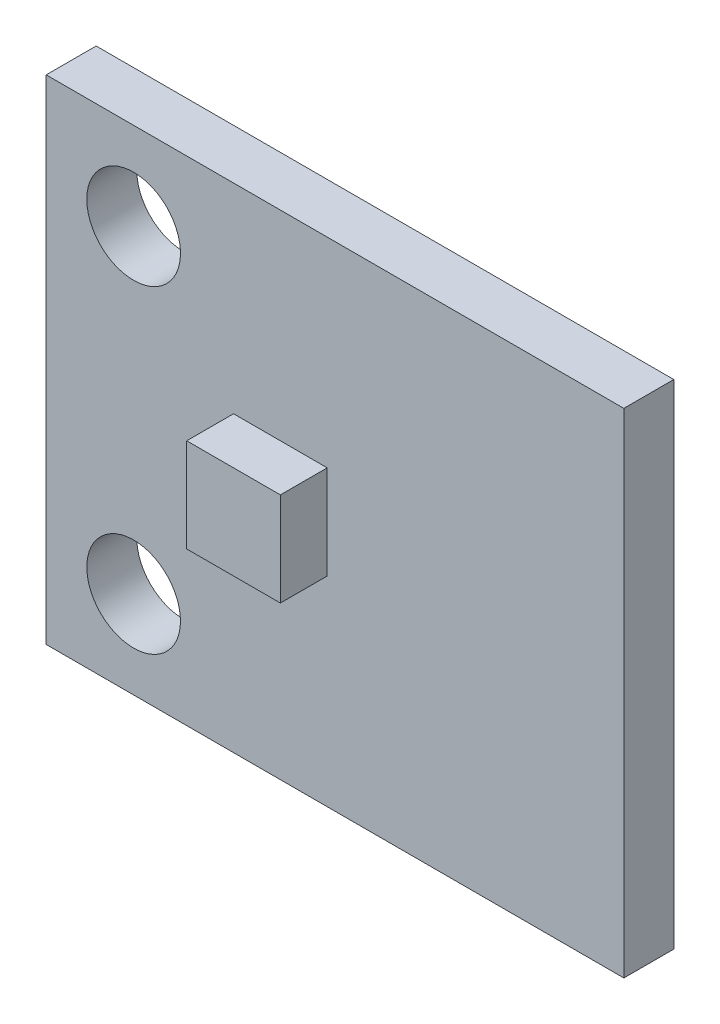
ISO-10303-21;
HEADER;
FILE_DESCRIPTION(('STEP AP214'),'2;1');
FILE_NAME('part.step','',(''),(''),'','','');
FILE_SCHEMA(('AUTOMOTIVE_DESIGN { 1 0 10303 214 1 1 1 1 }'));
ENDSEC;
DATA;
#1=APPLICATION_CONTEXT('core data for automotive mechanical design processes');
#2=APPLICATION_PROTOCOL_DEFINITION('international standard','automotive_design',2000,#1);
#3=PRODUCT_CONTEXT('',#1,'mechanical');
#4=PRODUCT('Part','Part','',(#3));
#5=PRODUCT_RELATED_PRODUCT_CATEGORY('part','',(#4));
#6=PRODUCT_DEFINITION_FORMATION('','',#4);
#7=PRODUCT_DEFINITION_CONTEXT('part definition',#1,'design');
#8=PRODUCT_DEFINITION('design','',#6,#7);
#9=PRODUCT_DEFINITION_SHAPE('','',#8);
#10=(LENGTH_UNIT() NAMED_UNIT(*) SI_UNIT(.MILLI.,.METRE.));
#11=(NAMED_UNIT(*) PLANE_ANGLE_UNIT() SI_UNIT($,.RADIAN.));
#12=(NAMED_UNIT(*) SI_UNIT($,.STERADIAN.) SOLID_ANGLE_UNIT());
#13=UNCERTAINTY_MEASURE_WITH_UNIT(LENGTH_MEASURE(1.E-05),#10,'distance_accuracy_value','');
#14=(GEOMETRIC_REPRESENTATION_CONTEXT(3) GLOBAL_UNCERTAINTY_ASSIGNED_CONTEXT((#13)) GLOBAL_UNIT_ASSIGNED_CONTEXT((#10,
#11,#12)) REPRESENTATION_CONTEXT('',''));
#15=CARTESIAN_POINT('',(0.,0.,0.));
#16=DIRECTION('',(0.,0.,1.));
#17=DIRECTION('',(1.,0.,0.));
#18=AXIS2_PLACEMENT_3D('',#15,#16,#17);
#19=CARTESIAN_POINT('',(0.,0.,1.6));
#20=DIRECTION('',(0.,0.,-1.));
#21=DIRECTION('',(-1.,0.,0.));
#22=AXIS2_PLACEMENT_3D('',#19,#20,#21);
#23=PLANE('',#22);
#24=DIRECTION('',(0.,-1.,0.));
#25=VECTOR('',#24,1.);
#26=CARTESIAN_POINT('',(0.,0.,1.6));
#27=LINE('',#26,#25);
#28=CARTESIAN_POINT('',(0.,15.8,1.6));
#29=VERTEX_POINT('',#28);
#30=CARTESIAN_POINT('',(0.,0.,1.6));
#31=VERTEX_POINT('',#30);
#32=EDGE_CURVE('E137',#29,#31,#27,.T.);
#33=ORIENTED_EDGE('',*,*,#32,.T.);
#34=DIRECTION('',(1.,0.,0.));
#35=VECTOR('',#34,1.);
#36=CARTESIAN_POINT('',(0.,0.,1.6));
#37=LINE('',#36,#35);
#38=CARTESIAN_POINT('',(18.5,0.,1.6));
#39=VERTEX_POINT('',#38);
#40=EDGE_CURVE('E140',#31,#39,#37,.T.);
#41=ORIENTED_EDGE('',*,*,#40,.T.);
#42=DIRECTION('',(0.,1.,0.));
#43=VECTOR('',#42,1.);
#44=CARTESIAN_POINT('',(18.5,0.,1.6));
#45=LINE('',#44,#43);
#46=CARTESIAN_POINT('',(18.5,15.8,1.6));
#47=VERTEX_POINT('',#46);
#48=EDGE_CURVE('E143',#39,#47,#45,.T.);
#49=ORIENTED_EDGE('',*,*,#48,.T.);
#50=DIRECTION('',(-1.,0.,0.));
#51=VECTOR('',#50,1.);
#52=CARTESIAN_POINT('',(0.,15.8,1.6));
#53=LINE('',#52,#51);
#54=EDGE_CURVE('E145',#47,#29,#53,.T.);
#55=ORIENTED_EDGE('',*,*,#54,.T.);
#56=EDGE_LOOP('',(#33,#41,#49,#55));
#57=FACE_BOUND('',#56,.T.);
#58=CARTESIAN_POINT('',(2.8,2.8,1.6));
#59=DIRECTION('',(0.,0.,-1.));
#60=DIRECTION('',(1.,0.,0.));
#61=AXIS2_PLACEMENT_3D('',#58,#59,#60);
#62=CIRCLE('',#61,1.5);
#63=CARTESIAN_POINT('',(4.3,2.8,1.6));
#64=VERTEX_POINT('',#63);
#65=EDGE_CURVE('E122',#64,#64,#62,.T.);
#66=ORIENTED_EDGE('',*,*,#65,.T.);
#67=EDGE_LOOP('',(#66));
#68=FACE_BOUND('',#67,.T.);
#69=CARTESIAN_POINT('',(2.8,13.,1.6));
#70=DIRECTION('',(0.,0.,-1.));
#71=DIRECTION('',(-1.,0.,0.));
#72=AXIS2_PLACEMENT_3D('',#69,#70,#71);
#73=CIRCLE('',#72,1.5);
#74=CARTESIAN_POINT('',(1.3,13.,1.6));
#75=VERTEX_POINT('',#74);
#76=EDGE_CURVE('E128',#75,#75,#73,.T.);
#77=ORIENTED_EDGE('',*,*,#76,.T.);
#78=EDGE_LOOP('',(#77));
#79=FACE_BOUND('',#78,.T.);
#80=DIRECTION('',(0.,-1.,0.));
#81=VECTOR('',#80,1.);
#82=CARTESIAN_POINT('',(6.,9.4,1.6));
#83=LINE('',#82,#81);
#84=CARTESIAN_POINT('',(6.,9.4,1.6));
#85=VERTEX_POINT('',#84);
#86=CARTESIAN_POINT('',(6.,6.4,1.6));
#87=VERTEX_POINT('',#86);
#88=EDGE_CURVE('E118',#85,#87,#83,.T.);
#89=ORIENTED_EDGE('',*,*,#88,.F.);
#90=DIRECTION('',(-1.,0.,0.));
#91=VECTOR('',#90,1.);
#92=CARTESIAN_POINT('',(6.,9.4,1.6));
#93=LINE('',#92,#91);
#94=CARTESIAN_POINT('',(9.,9.4,1.6));
#95=VERTEX_POINT('',#94);
#96=EDGE_CURVE('E115',#95,#85,#93,.T.);
#97=ORIENTED_EDGE('',*,*,#96,.F.);
#98=DIRECTION('',(0.,1.,0.));
#99=VECTOR('',#98,1.);
#100=CARTESIAN_POINT('',(9.,9.4,1.6));
#101=LINE('',#100,#99);
#102=CARTESIAN_POINT('',(9.,6.4,1.6));
#103=VERTEX_POINT('',#102);
#104=EDGE_CURVE('E53',#103,#95,#101,.T.);
#105=ORIENTED_EDGE('',*,*,#104,.F.);
#106=DIRECTION('',(1.,0.,0.));
#107=VECTOR('',#106,1.);
#108=CARTESIAN_POINT('',(6.,6.4,1.6));
#109=LINE('',#108,#107);
#110=EDGE_CURVE('E48',#87,#103,#109,.T.);
#111=ORIENTED_EDGE('',*,*,#110,.F.);
#112=EDGE_LOOP('',(#89,#97,#105,#111));
#113=FACE_BOUND('',#112,.T.);
#114=ADVANCED_FACE('F33',(#57,#68,#79,#113),#23,.F.);
#115=CARTESIAN_POINT('',(0.,0.,1.6));
#116=DIRECTION('',(1.,0.,0.));
#117=DIRECTION('',(0.,0.,-1.));
#118=AXIS2_PLACEMENT_3D('',#115,#116,#117);
#119=PLANE('',#118);
#120=DIRECTION('',(0.,-1.,0.));
#121=VECTOR('',#120,1.);
#122=CARTESIAN_POINT('',(0.,0.,0.));
#123=LINE('',#122,#121);
#124=CARTESIAN_POINT('',(0.,15.8,0.));
#125=VERTEX_POINT('',#124);
#126=CARTESIAN_POINT('',(0.,0.,0.));
#127=VERTEX_POINT('',#126);
#128=EDGE_CURVE('E131',#125,#127,#123,.T.);
#129=ORIENTED_EDGE('',*,*,#128,.T.);
#130=DIRECTION('',(0.,0.,-1.));
#131=VECTOR('',#130,1.);
#132=CARTESIAN_POINT('',(0.,0.,1.6));
#133=LINE('',#132,#131);
#134=EDGE_CURVE('E11',#31,#127,#133,.T.);
#135=ORIENTED_EDGE('',*,*,#134,.F.);
#136=ORIENTED_EDGE('',*,*,#32,.F.);
#137=DIRECTION('',(0.,0.,-1.));
#138=VECTOR('',#137,1.);
#139=CARTESIAN_POINT('',(0.,15.8,1.6));
#140=LINE('',#139,#138);
#141=EDGE_CURVE('E147',#29,#125,#140,.T.);
#142=ORIENTED_EDGE('',*,*,#141,.T.);
#143=EDGE_LOOP('',(#129,#135,#136,#142));
#144=FACE_BOUND('',#143,.T.);
#145=ADVANCED_FACE('F35',(#144),#119,.F.);
#146=CARTESIAN_POINT('',(0.,0.,1.6));
#147=DIRECTION('',(0.,1.,0.));
#148=DIRECTION('',(0.,0.,1.));
#149=AXIS2_PLACEMENT_3D('',#146,#147,#148);
#150=PLANE('',#149);
#151=DIRECTION('',(1.,0.,0.));
#152=VECTOR('',#151,1.);
#153=CARTESIAN_POINT('',(0.,0.,0.));
#154=LINE('',#153,#152);
#155=CARTESIAN_POINT('',(18.5,0.,0.));
#156=VERTEX_POINT('',#155);
#157=EDGE_CURVE('E150',#127,#156,#154,.T.);
#158=ORIENTED_EDGE('',*,*,#157,.T.);
#159=DIRECTION('',(0.,0.,-1.));
#160=VECTOR('',#159,1.);
#161=CARTESIAN_POINT('',(18.5,0.,1.6));
#162=LINE('',#161,#160);
#163=EDGE_CURVE('E41',#39,#156,#162,.T.);
#164=ORIENTED_EDGE('',*,*,#163,.F.);
#165=ORIENTED_EDGE('',*,*,#40,.F.);
#166=ORIENTED_EDGE('',*,*,#134,.T.);
#167=EDGE_LOOP('',(#158,#164,#165,#166));
#168=FACE_BOUND('',#167,.T.);
#169=ADVANCED_FACE('F180',(#168),#150,.F.);
#170=CARTESIAN_POINT('',(18.5,0.,1.6));
#171=DIRECTION('',(-1.,0.,0.));
#172=DIRECTION('',(0.,0.,1.));
#173=AXIS2_PLACEMENT_3D('',#170,#171,#172);
#174=PLANE('',#173);
#175=DIRECTION('',(0.,1.,0.));
#176=VECTOR('',#175,1.);
#177=CARTESIAN_POINT('',(18.5,0.,0.));
#178=LINE('',#177,#176);
#179=CARTESIAN_POINT('',(18.5,15.8,0.));
#180=VERTEX_POINT('',#179);
#181=EDGE_CURVE('E152',#156,#180,#178,.T.);
#182=ORIENTED_EDGE('',*,*,#181,.T.);
#183=DIRECTION('',(0.,0.,-1.));
#184=VECTOR('',#183,1.);
#185=CARTESIAN_POINT('',(18.5,15.8,1.6));
#186=LINE('',#185,#184);
#187=EDGE_CURVE('E157',#47,#180,#186,.T.);
#188=ORIENTED_EDGE('',*,*,#187,.F.);
#189=ORIENTED_EDGE('',*,*,#48,.F.);
#190=ORIENTED_EDGE('',*,*,#163,.T.);
#191=EDGE_LOOP('',(#182,#188,#189,#190));
#192=FACE_BOUND('',#191,.T.);
#193=ADVANCED_FACE('F164',(#192),#174,.F.);
#194=CARTESIAN_POINT('',(0.,15.8,1.6));
#195=DIRECTION('',(0.,-1.,0.));
#196=DIRECTION('',(0.,0.,-1.));
#197=AXIS2_PLACEMENT_3D('',#194,#195,#196);
#198=PLANE('',#197);
#199=DIRECTION('',(-1.,0.,0.));
#200=VECTOR('',#199,1.);
#201=CARTESIAN_POINT('',(0.,15.8,0.));
#202=LINE('',#201,#200);
#203=EDGE_CURVE('E141',#180,#125,#202,.T.);
#204=ORIENTED_EDGE('',*,*,#203,.T.);
#205=ORIENTED_EDGE('',*,*,#141,.F.);
#206=ORIENTED_EDGE('',*,*,#54,.F.);
#207=ORIENTED_EDGE('',*,*,#187,.T.);
#208=EDGE_LOOP('',(#204,#205,#206,#207));
#209=FACE_BOUND('',#208,.T.);
#210=ADVANCED_FACE('F173',(#209),#198,.F.);
#211=CARTESIAN_POINT('',(0.,0.,0.));
#212=DIRECTION('',(0.,0.,-1.));
#213=DIRECTION('',(-1.,0.,0.));
#214=AXIS2_PLACEMENT_3D('',#211,#212,#213);
#215=PLANE('',#214);
#216=CARTESIAN_POINT('',(2.8,13.,0.));
#217=DIRECTION('',(0.,0.,-1.));
#218=DIRECTION('',(-1.,0.,0.));
#219=AXIS2_PLACEMENT_3D('',#216,#217,#218);
#220=CIRCLE('',#219,1.5);
#221=CARTESIAN_POINT('',(1.3,13.,0.));
#222=VERTEX_POINT('',#221);
#223=EDGE_CURVE('E132',#222,#222,#220,.T.);
#224=ORIENTED_EDGE('',*,*,#223,.F.);
#225=EDGE_LOOP('',(#224));
#226=FACE_BOUND('',#225,.T.);
#227=CARTESIAN_POINT('',(2.8,2.8,0.));
#228=DIRECTION('',(0.,0.,-1.));
#229=DIRECTION('',(1.,0.,0.));
#230=AXIS2_PLACEMENT_3D('',#227,#228,#229);
#231=CIRCLE('',#230,1.5);
#232=CARTESIAN_POINT('',(4.3,2.8,0.));
#233=VERTEX_POINT('',#232);
#234=EDGE_CURVE('E119',#233,#233,#231,.T.);
#235=ORIENTED_EDGE('',*,*,#234,.F.);
#236=EDGE_LOOP('',(#235));
#237=FACE_BOUND('',#236,.T.);
#238=ORIENTED_EDGE('',*,*,#128,.F.);
#239=ORIENTED_EDGE('',*,*,#203,.F.);
#240=ORIENTED_EDGE('',*,*,#181,.F.);
#241=ORIENTED_EDGE('',*,*,#157,.F.);
#242=EDGE_LOOP('',(#238,#239,#240,#241));
#243=FACE_BOUND('',#242,.T.);
#244=ADVANCED_FACE('F170',(#226,#237,#243),#215,.T.);
#245=CARTESIAN_POINT('',(2.8,2.8,1.6));
#246=DIRECTION('',(0.,0.,-1.));
#247=DIRECTION('',(-1.,0.,0.));
#248=AXIS2_PLACEMENT_3D('',#245,#246,#247);
#249=CYLINDRICAL_SURFACE('',#248,1.5);
#250=ORIENTED_EDGE('',*,*,#65,.F.);
#251=EDGE_LOOP('',(#250));
#252=FACE_BOUND('',#251,.T.);
#253=ORIENTED_EDGE('',*,*,#234,.T.);
#254=EDGE_LOOP('',(#253));
#255=FACE_BOUND('',#254,.T.);
#256=ADVANCED_FACE('F193',(#252,#255),#249,.F.);
#257=CARTESIAN_POINT('',(2.8,13.,1.6));
#258=DIRECTION('',(0.,0.,-1.));
#259=DIRECTION('',(-1.,0.,0.));
#260=AXIS2_PLACEMENT_3D('',#257,#258,#259);
#261=CYLINDRICAL_SURFACE('',#260,1.5);
#262=ORIENTED_EDGE('',*,*,#76,.F.);
#263=EDGE_LOOP('',(#262));
#264=FACE_BOUND('',#263,.T.);
#265=ORIENTED_EDGE('',*,*,#223,.T.);
#266=EDGE_LOOP('',(#265));
#267=FACE_BOUND('',#266,.T.);
#268=ADVANCED_FACE('F213',(#264,#267),#261,.F.);
#269=CARTESIAN_POINT('',(6.,9.4,3.1));
#270=DIRECTION('',(1.,0.,0.));
#271=DIRECTION('',(0.,0.,-1.));
#272=AXIS2_PLACEMENT_3D('',#269,#270,#271);
#273=PLANE('',#272);
#274=ORIENTED_EDGE('',*,*,#88,.T.);
#275=DIRECTION('',(0.,0.,-1.));
#276=VECTOR('',#275,1.);
#277=CARTESIAN_POINT('',(6.,6.4,3.1));
#278=LINE('',#277,#276);
#279=CARTESIAN_POINT('',(6.,6.4,3.1));
#280=VERTEX_POINT('',#279);
#281=EDGE_CURVE('E99',#280,#87,#278,.T.);
#282=ORIENTED_EDGE('',*,*,#281,.F.);
#283=DIRECTION('',(0.,-1.,0.));
#284=VECTOR('',#283,1.);
#285=CARTESIAN_POINT('',(6.,9.4,3.1));
#286=LINE('',#285,#284);
#287=CARTESIAN_POINT('',(6.,9.4,3.1));
#288=VERTEX_POINT('',#287);
#289=EDGE_CURVE('E106',#288,#280,#286,.T.);
#290=ORIENTED_EDGE('',*,*,#289,.F.);
#291=DIRECTION('',(0.,0.,-1.));
#292=VECTOR('',#291,1.);
#293=CARTESIAN_POINT('',(6.,9.4,3.1));
#294=LINE('',#293,#292);
#295=EDGE_CURVE('E294',#288,#85,#294,.T.);
#296=ORIENTED_EDGE('',*,*,#295,.T.);
#297=EDGE_LOOP('',(#274,#282,#290,#296));
#298=FACE_BOUND('',#297,.T.);
#299=ADVANCED_FACE('F117',(#298),#273,.F.);
#300=CARTESIAN_POINT('',(6.,6.4,3.1));
#301=DIRECTION('',(0.,1.,0.));
#302=DIRECTION('',(0.,0.,1.));
#303=AXIS2_PLACEMENT_3D('',#300,#301,#302);
#304=PLANE('',#303);
#305=ORIENTED_EDGE('',*,*,#110,.T.);
#306=DIRECTION('',(0.,0.,-1.));
#307=VECTOR('',#306,1.);
#308=CARTESIAN_POINT('',(9.,6.4,3.1));
#309=LINE('',#308,#307);
#310=CARTESIAN_POINT('',(9.,6.4,3.1));
#311=VERTEX_POINT('',#310);
#312=EDGE_CURVE('E102',#311,#103,#309,.T.);
#313=ORIENTED_EDGE('',*,*,#312,.F.);
#314=DIRECTION('',(1.,0.,0.));
#315=VECTOR('',#314,1.);
#316=CARTESIAN_POINT('',(6.,6.4,3.1));
#317=LINE('',#316,#315);
#318=EDGE_CURVE('E95',#280,#311,#317,.T.);
#319=ORIENTED_EDGE('',*,*,#318,.F.);
#320=ORIENTED_EDGE('',*,*,#281,.T.);
#321=EDGE_LOOP('',(#305,#313,#319,#320));
#322=FACE_BOUND('',#321,.T.);
#323=ADVANCED_FACE('F97',(#322),#304,.F.);
#324=CARTESIAN_POINT('',(9.,9.4,3.1));
#325=DIRECTION('',(-1.,0.,0.));
#326=DIRECTION('',(0.,0.,1.));
#327=AXIS2_PLACEMENT_3D('',#324,#325,#326);
#328=PLANE('',#327);
#329=ORIENTED_EDGE('',*,*,#104,.T.);
#330=DIRECTION('',(0.,0.,-1.));
#331=VECTOR('',#330,1.);
#332=CARTESIAN_POINT('',(9.,9.4,3.1));
#333=LINE('',#332,#331);
#334=CARTESIAN_POINT('',(9.,9.4,3.1));
#335=VERTEX_POINT('',#334);
#336=EDGE_CURVE('E124',#335,#95,#333,.T.);
#337=ORIENTED_EDGE('',*,*,#336,.F.);
#338=DIRECTION('',(0.,1.,0.));
#339=VECTOR('',#338,1.);
#340=CARTESIAN_POINT('',(9.,9.4,3.1));
#341=LINE('',#340,#339);
#342=EDGE_CURVE('E105',#311,#335,#341,.T.);
#343=ORIENTED_EDGE('',*,*,#342,.F.);
#344=ORIENTED_EDGE('',*,*,#312,.T.);
#345=EDGE_LOOP('',(#329,#337,#343,#344));
#346=FACE_BOUND('',#345,.T.);
#347=ADVANCED_FACE('F232',(#346),#328,.F.);
#348=CARTESIAN_POINT('',(6.,9.4,3.1));
#349=DIRECTION('',(0.,-1.,0.));
#350=DIRECTION('',(0.,0.,-1.));
#351=AXIS2_PLACEMENT_3D('',#348,#349,#350);
#352=PLANE('',#351);
#353=ORIENTED_EDGE('',*,*,#96,.T.);
#354=ORIENTED_EDGE('',*,*,#295,.F.);
#355=DIRECTION('',(-1.,0.,0.));
#356=VECTOR('',#355,1.);
#357=CARTESIAN_POINT('',(6.,9.4,3.1));
#358=LINE('',#357,#356);
#359=EDGE_CURVE('E111',#335,#288,#358,.T.);
#360=ORIENTED_EDGE('',*,*,#359,.F.);
#361=ORIENTED_EDGE('',*,*,#336,.T.);
#362=EDGE_LOOP('',(#353,#354,#360,#361));
#363=FACE_BOUND('',#362,.T.);
#364=ADVANCED_FACE('F239',(#363),#352,.F.);
#365=CARTESIAN_POINT('',(0.,0.,3.1));
#366=DIRECTION('',(0.,0.,1.));
#367=DIRECTION('',(1.,0.,0.));
#368=AXIS2_PLACEMENT_3D('',#365,#366,#367);
#369=PLANE('',#368);
#370=ORIENTED_EDGE('',*,*,#289,.T.);
#371=ORIENTED_EDGE('',*,*,#318,.T.);
#372=ORIENTED_EDGE('',*,*,#342,.T.);
#373=ORIENTED_EDGE('',*,*,#359,.T.);
#374=EDGE_LOOP('',(#370,#371,#372,#373));
#375=FACE_BOUND('',#374,.T.);
#376=ADVANCED_FACE('F109',(#375),#369,.T.);
#377=CLOSED_SHELL('',(#114,#145,#169,#193,#210,#244,#256,#268,#299,#323,#347,#364,#376));
#378=MANIFOLD_SOLID_BREP('B2',#377);
#379=ADVANCED_BREP_SHAPE_REPRESENTATION('',(#18,#378),#14);
#380=SHAPE_DEFINITION_REPRESENTATION(#9,#379);
ENDSEC;
END-ISO-10303-21;
